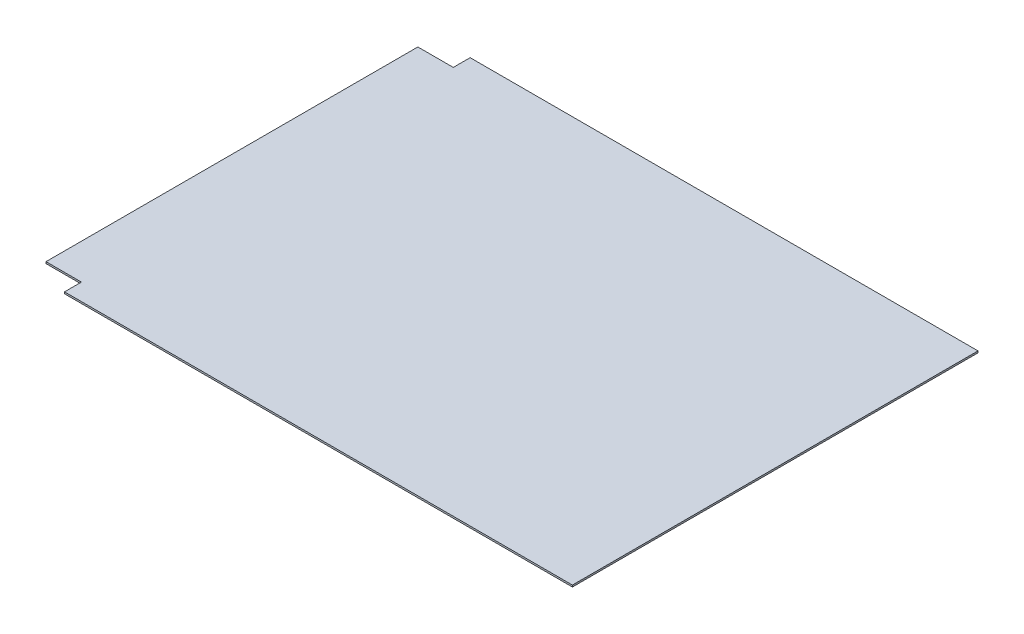
ISO-10303-21;
HEADER;
FILE_DESCRIPTION(('STEP AP214'),'2;1');
FILE_NAME('part.step','',(''),(''),'','','');
FILE_SCHEMA(('AUTOMOTIVE_DESIGN { 1 0 10303 214 1 1 1 1 }'));
ENDSEC;
DATA;
#1=APPLICATION_CONTEXT('core data for automotive mechanical design processes');
#2=APPLICATION_PROTOCOL_DEFINITION('international standard','automotive_design',2000,#1);
#3=PRODUCT_CONTEXT('',#1,'mechanical');
#4=PRODUCT('Part','Part','',(#3));
#5=PRODUCT_RELATED_PRODUCT_CATEGORY('part','',(#4));
#6=PRODUCT_DEFINITION_FORMATION('','',#4);
#7=PRODUCT_DEFINITION_CONTEXT('part definition',#1,'design');
#8=PRODUCT_DEFINITION('design','',#6,#7);
#9=PRODUCT_DEFINITION_SHAPE('','',#8);
#10=(LENGTH_UNIT() NAMED_UNIT(*) SI_UNIT(.MILLI.,.METRE.));
#11=(NAMED_UNIT(*) PLANE_ANGLE_UNIT() SI_UNIT($,.RADIAN.));
#12=(NAMED_UNIT(*) SI_UNIT($,.STERADIAN.) SOLID_ANGLE_UNIT());
#13=UNCERTAINTY_MEASURE_WITH_UNIT(LENGTH_MEASURE(1.E-05),#10,'distance_accuracy_value','');
#14=(GEOMETRIC_REPRESENTATION_CONTEXT(3) GLOBAL_UNCERTAINTY_ASSIGNED_CONTEXT((#13)) GLOBAL_UNIT_ASSIGNED_CONTEXT((#10,
#11,#12)) REPRESENTATION_CONTEXT('',''));
#15=CARTESIAN_POINT('',(0.,0.,0.));
#16=DIRECTION('',(0.,0.,1.));
#17=DIRECTION('',(1.,0.,0.));
#18=AXIS2_PLACEMENT_3D('',#15,#16,#17);
#19=CARTESIAN_POINT('',(0.,1.31064,0.));
#20=DIRECTION('',(-1.,0.,0.));
#21=DIRECTION('',(0.,0.,1.));
#22=AXIS2_PLACEMENT_3D('',#19,#20,#21);
#23=PLANE('',#22);
#24=DIRECTION('',(0.,0.,-1.));
#25=VECTOR('',#24,1.);
#26=CARTESIAN_POINT('',(0.,0.,0.));
#27=LINE('',#26,#25);
#28=CARTESIAN_POINT('',(0.,0.,0.));
#29=VERTEX_POINT('',#28);
#30=CARTESIAN_POINT('',(0.,0.,-305.4));
#31=VERTEX_POINT('',#30);
#32=EDGE_CURVE('E144',#29,#31,#27,.T.);
#33=ORIENTED_EDGE('',*,*,#32,.T.);
#34=DIRECTION('',(0.,-1.,0.));
#35=VECTOR('',#34,1.);
#36=CARTESIAN_POINT('',(0.,1.31064,-305.4));
#37=LINE('',#36,#35);
#38=CARTESIAN_POINT('',(0.,1.31064,-305.4));
#39=VERTEX_POINT('',#38);
#40=EDGE_CURVE('E11',#39,#31,#37,.T.);
#41=ORIENTED_EDGE('',*,*,#40,.F.);
#42=DIRECTION('',(0.,0.,-1.));
#43=VECTOR('',#42,1.);
#44=CARTESIAN_POINT('',(0.,1.31064,0.));
#45=LINE('',#44,#43);
#46=CARTESIAN_POINT('',(0.,1.31064,0.));
#47=VERTEX_POINT('',#46);
#48=EDGE_CURVE('E166',#47,#39,#45,.T.);
#49=ORIENTED_EDGE('',*,*,#48,.F.);
#50=DIRECTION('',(0.,-1.,0.));
#51=VECTOR('',#50,1.);
#52=CARTESIAN_POINT('',(0.,1.31064,0.));
#53=LINE('',#52,#51);
#54=EDGE_CURVE('E140',#47,#29,#53,.T.);
#55=ORIENTED_EDGE('',*,*,#54,.T.);
#56=EDGE_LOOP('',(#33,#41,#49,#55));
#57=FACE_BOUND('',#56,.T.);
#58=ADVANCED_FACE('F43',(#57),#23,.F.);
#59=CARTESIAN_POINT('',(0.,1.31064,-305.4));
#60=DIRECTION('',(0.,0.,1.));
#61=DIRECTION('',(1.,0.,0.));
#62=AXIS2_PLACEMENT_3D('',#59,#60,#61);
#63=PLANE('',#62);
#64=DIRECTION('',(-1.,0.,0.));
#65=VECTOR('',#64,1.);
#66=CARTESIAN_POINT('',(0.,0.,-305.4));
#67=LINE('',#66,#65);
#68=CARTESIAN_POINT('',(-382.408,0.,-305.4));
#69=VERTEX_POINT('',#68);
#70=EDGE_CURVE('E148',#31,#69,#67,.T.);
#71=ORIENTED_EDGE('',*,*,#70,.T.);
#72=DIRECTION('',(0.,-1.,0.));
#73=VECTOR('',#72,1.);
#74=CARTESIAN_POINT('',(-382.408,1.31064,-305.4));
#75=LINE('',#74,#73);
#76=CARTESIAN_POINT('',(-382.408,1.31064,-305.4));
#77=VERTEX_POINT('',#76);
#78=EDGE_CURVE('E52',#77,#69,#75,.T.);
#79=ORIENTED_EDGE('',*,*,#78,.F.);
#80=DIRECTION('',(-1.,0.,0.));
#81=VECTOR('',#80,1.);
#82=CARTESIAN_POINT('',(0.,1.31064,-305.4));
#83=LINE('',#82,#81);
#84=EDGE_CURVE('E103',#39,#77,#83,.T.);
#85=ORIENTED_EDGE('',*,*,#84,.F.);
#86=ORIENTED_EDGE('',*,*,#40,.T.);
#87=EDGE_LOOP('',(#71,#79,#85,#86));
#88=FACE_BOUND('',#87,.T.);
#89=ADVANCED_FACE('F212',(#88),#63,.F.);
#90=CARTESIAN_POINT('',(-382.408,1.31064,-305.4));
#91=DIRECTION('',(1.,0.,0.));
#92=DIRECTION('',(0.,0.,-1.));
#93=AXIS2_PLACEMENT_3D('',#90,#91,#92);
#94=PLANE('',#93);
#95=DIRECTION('',(0.,0.,1.));
#96=VECTOR('',#95,1.);
#97=CARTESIAN_POINT('',(-382.408,0.,-305.4));
#98=LINE('',#97,#96);
#99=CARTESIAN_POINT('',(-382.408,0.,-292.7));
#100=VERTEX_POINT('',#99);
#101=EDGE_CURVE('E151',#69,#100,#98,.T.);
#102=ORIENTED_EDGE('',*,*,#101,.T.);
#103=DIRECTION('',(0.,-1.,0.));
#104=VECTOR('',#103,1.);
#105=CARTESIAN_POINT('',(-382.408,1.31064,-292.7));
#106=LINE('',#105,#104);
#107=CARTESIAN_POINT('',(-382.408,1.31064,-292.7));
#108=VERTEX_POINT('',#107);
#109=EDGE_CURVE('E177',#108,#100,#106,.T.);
#110=ORIENTED_EDGE('',*,*,#109,.F.);
#111=DIRECTION('',(0.,0.,1.));
#112=VECTOR('',#111,1.);
#113=CARTESIAN_POINT('',(-382.408,1.31064,-305.4));
#114=LINE('',#113,#112);
#115=EDGE_CURVE('E187',#77,#108,#114,.T.);
#116=ORIENTED_EDGE('',*,*,#115,.F.);
#117=ORIENTED_EDGE('',*,*,#78,.T.);
#118=EDGE_LOOP('',(#102,#110,#116,#117));
#119=FACE_BOUND('',#118,.T.);
#120=ADVANCED_FACE('F185',(#119),#94,.F.);
#121=CARTESIAN_POINT('',(-382.408,1.31064,-292.7));
#122=DIRECTION('',(0.,0.,1.));
#123=DIRECTION('',(1.,0.,0.));
#124=AXIS2_PLACEMENT_3D('',#121,#122,#123);
#125=PLANE('',#124);
#126=DIRECTION('',(-1.,0.,0.));
#127=VECTOR('',#126,1.);
#128=CARTESIAN_POINT('',(-382.408,0.,-292.7));
#129=LINE('',#128,#127);
#130=CARTESIAN_POINT('',(-409.078,0.,-292.7));
#131=VERTEX_POINT('',#130);
#132=EDGE_CURVE('E154',#100,#131,#129,.T.);
#133=ORIENTED_EDGE('',*,*,#132,.T.);
#134=DIRECTION('',(0.,-1.,0.));
#135=VECTOR('',#134,1.);
#136=CARTESIAN_POINT('',(-409.078,1.31064,-292.7));
#137=LINE('',#136,#135);
#138=CARTESIAN_POINT('',(-409.078,1.31064,-292.7));
#139=VERTEX_POINT('',#138);
#140=EDGE_CURVE('E173',#139,#131,#137,.T.);
#141=ORIENTED_EDGE('',*,*,#140,.F.);
#142=DIRECTION('',(-1.,0.,0.));
#143=VECTOR('',#142,1.);
#144=CARTESIAN_POINT('',(-382.408,1.31064,-292.7));
#145=LINE('',#144,#143);
#146=EDGE_CURVE('E200',#108,#139,#145,.T.);
#147=ORIENTED_EDGE('',*,*,#146,.F.);
#148=ORIENTED_EDGE('',*,*,#109,.T.);
#149=EDGE_LOOP('',(#133,#141,#147,#148));
#150=FACE_BOUND('',#149,.T.);
#151=ADVANCED_FACE('F195',(#150),#125,.F.);
#152=CARTESIAN_POINT('',(-409.078,1.31064,-12.6999999999999));
#153=DIRECTION('',(1.,0.,0.));
#154=DIRECTION('',(0.,0.,-1.));
#155=AXIS2_PLACEMENT_3D('',#152,#153,#154);
#156=PLANE('',#155);
#157=DIRECTION('',(0.,0.,1.));
#158=VECTOR('',#157,1.);
#159=CARTESIAN_POINT('',(-409.078,0.,-12.6999999999999));
#160=LINE('',#159,#158);
#161=CARTESIAN_POINT('',(-409.078,0.,-12.6999999999999));
#162=VERTEX_POINT('',#161);
#163=EDGE_CURVE('E157',#131,#162,#160,.T.);
#164=ORIENTED_EDGE('',*,*,#163,.T.);
#165=DIRECTION('',(0.,-1.,0.));
#166=VECTOR('',#165,1.);
#167=CARTESIAN_POINT('',(-409.078,1.31064,-12.6999999999999));
#168=LINE('',#167,#166);
#169=CARTESIAN_POINT('',(-409.078,1.31064,-12.6999999999999));
#170=VERTEX_POINT('',#169);
#171=EDGE_CURVE('E133',#170,#162,#168,.T.);
#172=ORIENTED_EDGE('',*,*,#171,.F.);
#173=DIRECTION('',(0.,0.,1.));
#174=VECTOR('',#173,1.);
#175=CARTESIAN_POINT('',(-409.078,1.31064,-12.6999999999999));
#176=LINE('',#175,#174);
#177=EDGE_CURVE('E122',#139,#170,#176,.T.);
#178=ORIENTED_EDGE('',*,*,#177,.F.);
#179=ORIENTED_EDGE('',*,*,#140,.T.);
#180=EDGE_LOOP('',(#164,#172,#178,#179));
#181=FACE_BOUND('',#180,.T.);
#182=ADVANCED_FACE('F198',(#181),#156,.F.);
#183=CARTESIAN_POINT('',(-382.408,1.31064,-12.7));
#184=DIRECTION('',(0.,0.,-1.));
#185=DIRECTION('',(-1.,0.,0.));
#186=AXIS2_PLACEMENT_3D('',#183,#184,#185);
#187=PLANE('',#186);
#188=DIRECTION('',(1.,0.,0.));
#189=VECTOR('',#188,1.);
#190=CARTESIAN_POINT('',(-382.408,0.,-12.7));
#191=LINE('',#190,#189);
#192=CARTESIAN_POINT('',(-382.408,0.,-12.7));
#193=VERTEX_POINT('',#192);
#194=EDGE_CURVE('E131',#162,#193,#191,.T.);
#195=ORIENTED_EDGE('',*,*,#194,.T.);
#196=DIRECTION('',(0.,-1.,0.));
#197=VECTOR('',#196,1.);
#198=CARTESIAN_POINT('',(-382.408,1.31064,-12.7));
#199=LINE('',#198,#197);
#200=CARTESIAN_POINT('',(-382.408,1.31064,-12.7));
#201=VERTEX_POINT('',#200);
#202=EDGE_CURVE('E128',#201,#193,#199,.T.);
#203=ORIENTED_EDGE('',*,*,#202,.F.);
#204=DIRECTION('',(1.,0.,0.));
#205=VECTOR('',#204,1.);
#206=CARTESIAN_POINT('',(-382.408,1.31064,-12.7));
#207=LINE('',#206,#205);
#208=EDGE_CURVE('E116',#170,#201,#207,.T.);
#209=ORIENTED_EDGE('',*,*,#208,.F.);
#210=ORIENTED_EDGE('',*,*,#171,.T.);
#211=EDGE_LOOP('',(#195,#203,#209,#210));
#212=FACE_BOUND('',#211,.T.);
#213=ADVANCED_FACE('F129',(#212),#187,.F.);
#214=CARTESIAN_POINT('',(-382.408,1.31064,0.));
#215=DIRECTION('',(1.,0.,0.));
#216=DIRECTION('',(0.,0.,-1.));
#217=AXIS2_PLACEMENT_3D('',#214,#215,#216);
#218=PLANE('',#217);
#219=DIRECTION('',(0.,0.,1.));
#220=VECTOR('',#219,1.);
#221=CARTESIAN_POINT('',(-382.408,0.,0.));
#222=LINE('',#221,#220);
#223=CARTESIAN_POINT('',(-382.408,0.,0.));
#224=VERTEX_POINT('',#223);
#225=EDGE_CURVE('E89',#193,#224,#222,.T.);
#226=ORIENTED_EDGE('',*,*,#225,.T.);
#227=DIRECTION('',(0.,-1.,0.));
#228=VECTOR('',#227,1.);
#229=CARTESIAN_POINT('',(-382.408,1.31064,0.));
#230=LINE('',#229,#228);
#231=CARTESIAN_POINT('',(-382.408,1.31064,0.));
#232=VERTEX_POINT('',#231);
#233=EDGE_CURVE('E134',#232,#224,#230,.T.);
#234=ORIENTED_EDGE('',*,*,#233,.F.);
#235=DIRECTION('',(0.,0.,1.));
#236=VECTOR('',#235,1.);
#237=CARTESIAN_POINT('',(-382.408,1.31064,0.));
#238=LINE('',#237,#236);
#239=EDGE_CURVE('E120',#201,#232,#238,.T.);
#240=ORIENTED_EDGE('',*,*,#239,.F.);
#241=ORIENTED_EDGE('',*,*,#202,.T.);
#242=EDGE_LOOP('',(#226,#234,#240,#241));
#243=FACE_BOUND('',#242,.T.);
#244=ADVANCED_FACE('F136',(#243),#218,.F.);
#245=CARTESIAN_POINT('',(0.,1.31064,0.));
#246=DIRECTION('',(0.,0.,-1.));
#247=DIRECTION('',(-1.,0.,0.));
#248=AXIS2_PLACEMENT_3D('',#245,#246,#247);
#249=PLANE('',#248);
#250=DIRECTION('',(1.,0.,0.));
#251=VECTOR('',#250,1.);
#252=CARTESIAN_POINT('',(0.,0.,0.));
#253=LINE('',#252,#251);
#254=EDGE_CURVE('E95',#224,#29,#253,.T.);
#255=ORIENTED_EDGE('',*,*,#254,.T.);
#256=ORIENTED_EDGE('',*,*,#54,.F.);
#257=DIRECTION('',(1.,0.,0.));
#258=VECTOR('',#257,1.);
#259=CARTESIAN_POINT('',(0.,1.31064,0.));
#260=LINE('',#259,#258);
#261=EDGE_CURVE('E60',#232,#47,#260,.T.);
#262=ORIENTED_EDGE('',*,*,#261,.F.);
#263=ORIENTED_EDGE('',*,*,#233,.T.);
#264=EDGE_LOOP('',(#255,#256,#262,#263));
#265=FACE_BOUND('',#264,.T.);
#266=ADVANCED_FACE('F228',(#265),#249,.F.);
#267=CARTESIAN_POINT('',(0.,1.31064,0.));
#268=DIRECTION('',(0.,1.,0.));
#269=DIRECTION('',(0.,0.,1.));
#270=AXIS2_PLACEMENT_3D('',#267,#268,#269);
#271=PLANE('',#270);
#272=ORIENTED_EDGE('',*,*,#48,.T.);
#273=ORIENTED_EDGE('',*,*,#84,.T.);
#274=ORIENTED_EDGE('',*,*,#115,.T.);
#275=ORIENTED_EDGE('',*,*,#146,.T.);
#276=ORIENTED_EDGE('',*,*,#177,.T.);
#277=ORIENTED_EDGE('',*,*,#208,.T.);
#278=ORIENTED_EDGE('',*,*,#239,.T.);
#279=ORIENTED_EDGE('',*,*,#261,.T.);
#280=EDGE_LOOP('',(#272,#273,#274,#275,#276,#277,#278,#279));
#281=FACE_BOUND('',#280,.T.);
#282=ADVANCED_FACE('F118',(#281),#271,.T.);
#283=CARTESIAN_POINT('',(0.,0.,0.));
#284=DIRECTION('',(0.,1.,0.));
#285=DIRECTION('',(0.,0.,1.));
#286=AXIS2_PLACEMENT_3D('',#283,#284,#285);
#287=PLANE('',#286);
#288=ORIENTED_EDGE('',*,*,#32,.F.);
#289=ORIENTED_EDGE('',*,*,#254,.F.);
#290=ORIENTED_EDGE('',*,*,#225,.F.);
#291=ORIENTED_EDGE('',*,*,#194,.F.);
#292=ORIENTED_EDGE('',*,*,#163,.F.);
#293=ORIENTED_EDGE('',*,*,#132,.F.);
#294=ORIENTED_EDGE('',*,*,#101,.F.);
#295=ORIENTED_EDGE('',*,*,#70,.F.);
#296=EDGE_LOOP('',(#288,#289,#290,#291,#292,#293,#294,#295));
#297=FACE_BOUND('',#296,.T.);
#298=ADVANCED_FACE('F191',(#297),#287,.F.);
#299=CLOSED_SHELL('',(#58,#89,#120,#151,#182,#213,#244,#266,#282,#298));
#300=MANIFOLD_SOLID_BREP('B2',#299);
#301=ADVANCED_BREP_SHAPE_REPRESENTATION('',(#18,#300),#14);
#302=SHAPE_DEFINITION_REPRESENTATION(#9,#301);
ENDSEC;
END-ISO-10303-21;
